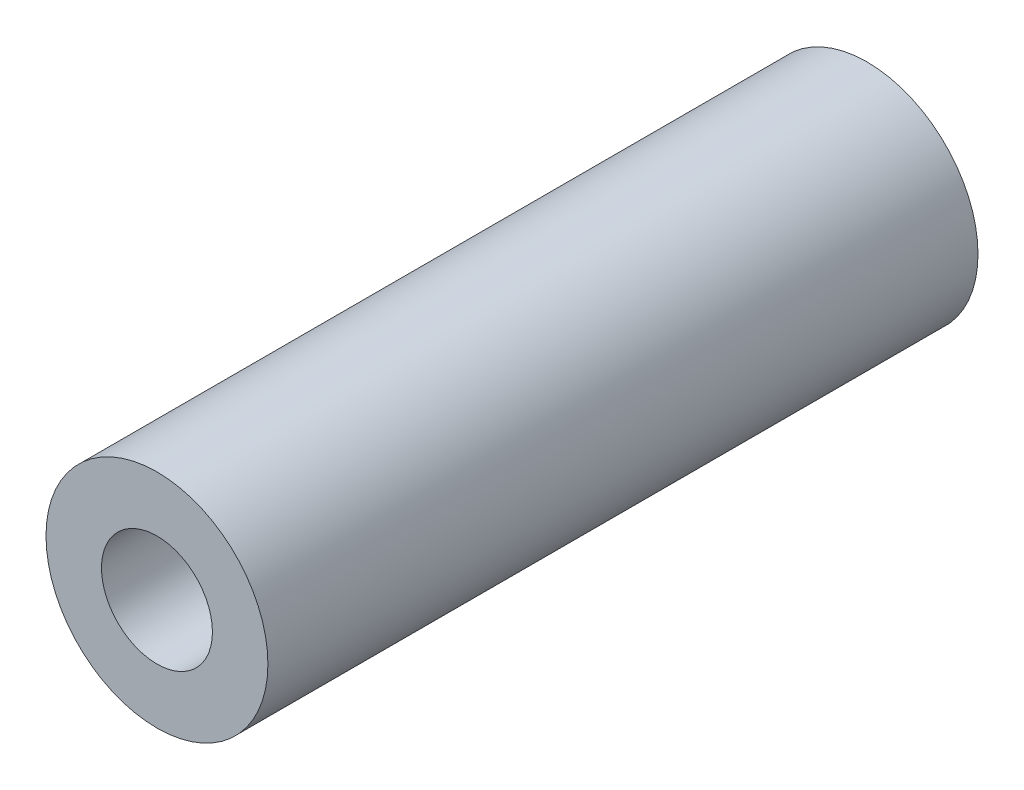
ISO-10303-21;
HEADER;
FILE_DESCRIPTION(('STEP AP214'),'2;1');
FILE_NAME('part.step','',(''),(''),'','','');
FILE_SCHEMA(('AUTOMOTIVE_DESIGN { 1 0 10303 214 1 1 1 1 }'));
ENDSEC;
DATA;
#1=APPLICATION_CONTEXT('core data for automotive mechanical design processes');
#2=APPLICATION_PROTOCOL_DEFINITION('international standard','automotive_design',2000,#1);
#3=PRODUCT_CONTEXT('',#1,'mechanical');
#4=PRODUCT('Part','Part','',(#3));
#5=PRODUCT_RELATED_PRODUCT_CATEGORY('part','',(#4));
#6=PRODUCT_DEFINITION_FORMATION('','',#4);
#7=PRODUCT_DEFINITION_CONTEXT('part definition',#1,'design');
#8=PRODUCT_DEFINITION('design','',#6,#7);
#9=PRODUCT_DEFINITION_SHAPE('','',#8);
#10=(LENGTH_UNIT() NAMED_UNIT(*) SI_UNIT(.MILLI.,.METRE.));
#11=(NAMED_UNIT(*) PLANE_ANGLE_UNIT() SI_UNIT($,.RADIAN.));
#12=(NAMED_UNIT(*) SI_UNIT($,.STERADIAN.) SOLID_ANGLE_UNIT());
#13=UNCERTAINTY_MEASURE_WITH_UNIT(LENGTH_MEASURE(1.E-05),#10,'distance_accuracy_value','');
#14=(GEOMETRIC_REPRESENTATION_CONTEXT(3) GLOBAL_UNCERTAINTY_ASSIGNED_CONTEXT((#13)) GLOBAL_UNIT_ASSIGNED_CONTEXT((#10,
#11,#12)) REPRESENTATION_CONTEXT('',''));
#15=CARTESIAN_POINT('',(0.,0.,0.));
#16=DIRECTION('',(0.,0.,1.));
#17=DIRECTION('',(1.,0.,0.));
#18=AXIS2_PLACEMENT_3D('',#15,#16,#17);
#19=CARTESIAN_POINT('',(0.,0.,16.));
#20=DIRECTION('',(0.,0.,-1.));
#21=DIRECTION('',(-1.,0.,0.));
#22=AXIS2_PLACEMENT_3D('',#19,#20,#21);
#23=CYLINDRICAL_SURFACE('',#22,2.5);
#24=CARTESIAN_POINT('',(0.,0.,16.));
#25=DIRECTION('',(0.,0.,1.));
#26=DIRECTION('',(1.,0.,0.));
#27=AXIS2_PLACEMENT_3D('',#24,#25,#26);
#28=CIRCLE('',#27,2.5);
#29=CARTESIAN_POINT('',(2.5,0.,16.));
#30=VERTEX_POINT('',#29);
#31=EDGE_CURVE('E10',#30,#30,#28,.T.);
#32=ORIENTED_EDGE('',*,*,#31,.F.);
#33=EDGE_LOOP('',(#32));
#34=FACE_BOUND('',#33,.T.);
#35=CARTESIAN_POINT('',(0.,0.,0.));
#36=DIRECTION('',(0.,0.,1.));
#37=DIRECTION('',(1.,0.,0.));
#38=AXIS2_PLACEMENT_3D('',#35,#36,#37);
#39=CIRCLE('',#38,2.5);
#40=CARTESIAN_POINT('',(2.5,0.,0.));
#41=VERTEX_POINT('',#40);
#42=EDGE_CURVE('E37',#41,#41,#39,.T.);
#43=ORIENTED_EDGE('',*,*,#42,.T.);
#44=EDGE_LOOP('',(#43));
#45=FACE_BOUND('',#44,.T.);
#46=ADVANCED_FACE('F34',(#34,#45),#23,.T.);
#47=CARTESIAN_POINT('',(0.,0.,16.));
#48=DIRECTION('',(0.,0.,1.));
#49=DIRECTION('',(1.,0.,0.));
#50=AXIS2_PLACEMENT_3D('',#47,#48,#49);
#51=PLANE('',#50);
#52=CARTESIAN_POINT('',(0.,0.,16.));
#53=DIRECTION('',(0.,0.,1.));
#54=DIRECTION('',(1.,0.,0.));
#55=AXIS2_PLACEMENT_3D('',#52,#53,#54);
#56=CIRCLE('',#55,1.25);
#57=CARTESIAN_POINT('',(1.25,0.,16.));
#58=VERTEX_POINT('',#57);
#59=EDGE_CURVE('E48',#58,#58,#56,.T.);
#60=ORIENTED_EDGE('',*,*,#59,.F.);
#61=EDGE_LOOP('',(#60));
#62=FACE_BOUND('',#61,.T.);
#63=ORIENTED_EDGE('',*,*,#31,.T.);
#64=EDGE_LOOP('',(#63));
#65=FACE_BOUND('',#64,.T.);
#66=ADVANCED_FACE('F54',(#62,#65),#51,.T.);
#67=CARTESIAN_POINT('',(0.,0.,0.));
#68=DIRECTION('',(0.,0.,1.));
#69=DIRECTION('',(1.,0.,0.));
#70=AXIS2_PLACEMENT_3D('',#67,#68,#69);
#71=PLANE('',#70);
#72=CARTESIAN_POINT('',(0.,0.,0.));
#73=DIRECTION('',(0.,0.,1.));
#74=DIRECTION('',(1.,0.,0.));
#75=AXIS2_PLACEMENT_3D('',#72,#73,#74);
#76=CIRCLE('',#75,1.25);
#77=CARTESIAN_POINT('',(1.25,0.,0.));
#78=VERTEX_POINT('',#77);
#79=EDGE_CURVE('E44',#78,#78,#76,.T.);
#80=ORIENTED_EDGE('',*,*,#79,.T.);
#81=EDGE_LOOP('',(#80));
#82=FACE_BOUND('',#81,.T.);
#83=ORIENTED_EDGE('',*,*,#42,.F.);
#84=EDGE_LOOP('',(#83));
#85=FACE_BOUND('',#84,.T.);
#86=ADVANCED_FACE('F56',(#82,#85),#71,.F.);
#87=CARTESIAN_POINT('',(0.,0.,16.));
#88=DIRECTION('',(0.,0.,1.));
#89=DIRECTION('',(1.,0.,0.));
#90=AXIS2_PLACEMENT_3D('',#87,#88,#89);
#91=CYLINDRICAL_SURFACE('',#90,1.25);
#92=ORIENTED_EDGE('',*,*,#79,.F.);
#93=EDGE_LOOP('',(#92));
#94=FACE_BOUND('',#93,.T.);
#95=ORIENTED_EDGE('',*,*,#59,.T.);
#96=EDGE_LOOP('',(#95));
#97=FACE_BOUND('',#96,.T.);
#98=ADVANCED_FACE('F52',(#94,#97),#91,.F.);
#99=CLOSED_SHELL('',(#46,#66,#86,#98));
#100=MANIFOLD_SOLID_BREP('B2',#99);
#101=ADVANCED_BREP_SHAPE_REPRESENTATION('',(#18,#100),#14);
#102=SHAPE_DEFINITION_REPRESENTATION(#9,#101);
ENDSEC;
END-ISO-10303-21;
